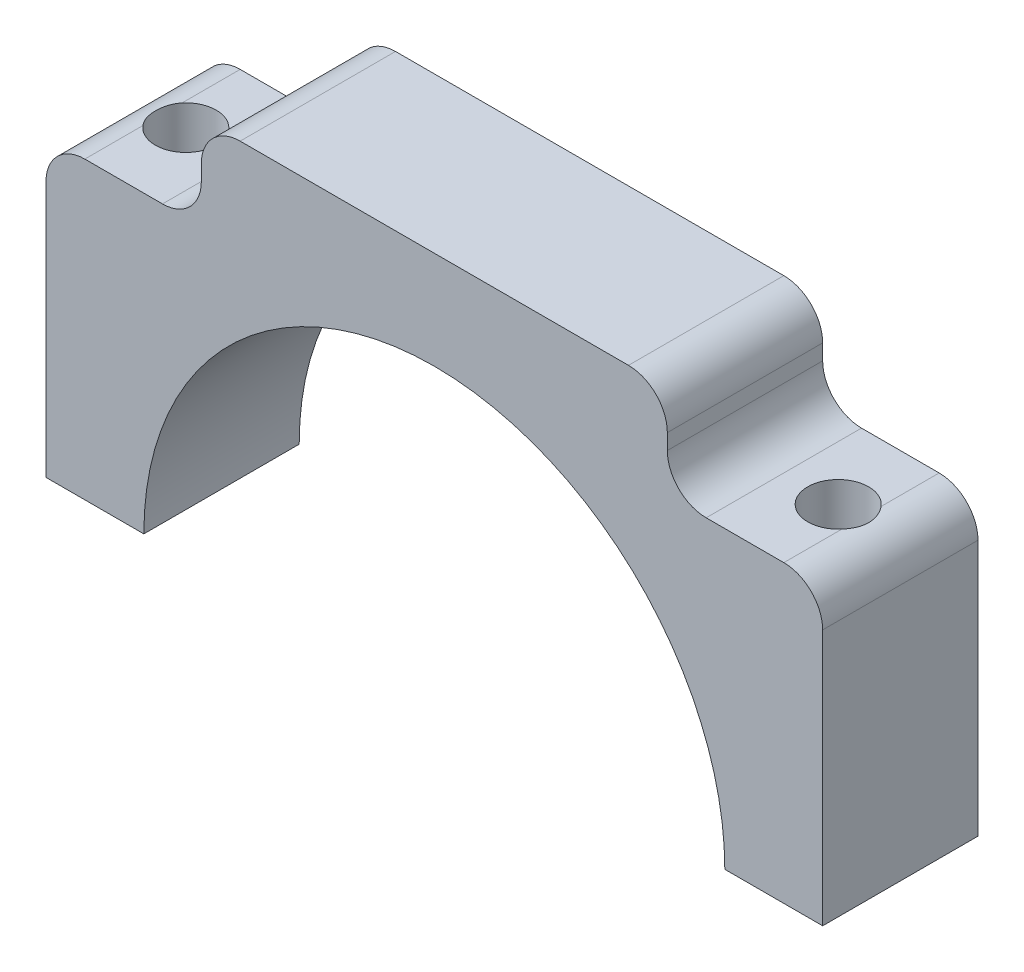
ISO-10303-21;
HEADER;
FILE_DESCRIPTION(('STEP AP214'),'2;1');
FILE_NAME('part.step','',(''),(''),'','','');
FILE_SCHEMA(('AUTOMOTIVE_DESIGN { 1 0 10303 214 1 1 1 1 }'));
ENDSEC;
DATA;
#1=APPLICATION_CONTEXT('core data for automotive mechanical design processes');
#2=APPLICATION_PROTOCOL_DEFINITION('international standard','automotive_design',2000,#1);
#3=PRODUCT_CONTEXT('',#1,'mechanical');
#4=PRODUCT('Part','Part','',(#3));
#5=PRODUCT_RELATED_PRODUCT_CATEGORY('part','',(#4));
#6=PRODUCT_DEFINITION_FORMATION('','',#4);
#7=PRODUCT_DEFINITION_CONTEXT('part definition',#1,'design');
#8=PRODUCT_DEFINITION('design','',#6,#7);
#9=PRODUCT_DEFINITION_SHAPE('','',#8);
#10=(LENGTH_UNIT() NAMED_UNIT(*) SI_UNIT(.MILLI.,.METRE.));
#11=(NAMED_UNIT(*) PLANE_ANGLE_UNIT() SI_UNIT($,.RADIAN.));
#12=(NAMED_UNIT(*) SI_UNIT($,.STERADIAN.) SOLID_ANGLE_UNIT());
#13=UNCERTAINTY_MEASURE_WITH_UNIT(LENGTH_MEASURE(1.E-05),#10,'distance_accuracy_value','');
#14=(GEOMETRIC_REPRESENTATION_CONTEXT(3) GLOBAL_UNCERTAINTY_ASSIGNED_CONTEXT((#13)) GLOBAL_UNIT_ASSIGNED_CONTEXT((#10,
#11,#12)) REPRESENTATION_CONTEXT('',''));
#15=CARTESIAN_POINT('',(0.,0.,0.));
#16=DIRECTION('',(0.,0.,1.));
#17=DIRECTION('',(1.,0.,0.));
#18=AXIS2_PLACEMENT_3D('',#15,#16,#17);
#19=CARTESIAN_POINT('',(5.08,0.,6.35));
#20=DIRECTION('',(0.,1.,0.));
#21=DIRECTION('',(0.,0.,1.));
#22=AXIS2_PLACEMENT_3D('',#19,#20,#21);
#23=CYLINDRICAL_SURFACE('',#22,2.4892);
#24=CARTESIAN_POINT('',(5.08,0.,6.35));
#25=DIRECTION('',(0.,1.,0.));
#26=DIRECTION('',(0.,0.,1.));
#27=AXIS2_PLACEMENT_3D('',#24,#25,#26);
#28=CIRCLE('',#27,2.4892);
#29=CARTESIAN_POINT('',(5.08,0.,8.8392));
#30=VERTEX_POINT('',#29);
#31=EDGE_CURVE('E20',#30,#30,#28,.T.);
#32=ORIENTED_EDGE('',*,*,#31,.F.);
#33=EDGE_LOOP('',(#32));
#34=FACE_BOUND('',#33,.T.);
#35=CARTESIAN_POINT('',(3.17500000000001,24.13,7.95221460485168));
#36=CARTESIAN_POINT('',(3.13009008970398,24.1299967142231,7.89881831780775));
#37=CARTESIAN_POINT('',(3.08745644404655,24.1290478568266,7.8435672925134));
#38=CARTESIAN_POINT('',(3.00699891355422,24.1258080863664,7.72972582153411));
#39=CARTESIAN_POINT('',(2.96917368836943,24.1235175482998,7.67113631307729));
#40=CARTESIAN_POINT('',(2.86332907607308,24.1154607832854,7.4909851985496));
#41=CARTESIAN_POINT('',(2.80285253669607,24.1085072655136,7.36493585667964));
#42=CARTESIAN_POINT('',(2.70382466724712,24.0952441325717,7.10454246043218));
#43=CARTESIAN_POINT('',(2.66527289966045,24.0889345045547,6.97019857163392));
#44=CARTESIAN_POINT('',(2.61116595259049,24.07965690608,6.69690903039815));
#45=CARTESIAN_POINT('',(2.59559400457558,24.0766864993471,6.55796680916758));
#46=CARTESIAN_POINT('',(2.58791295947405,24.075251820073,6.27981471864946));
#47=CARTESIAN_POINT('',(2.59573673857648,24.0767746559696,6.14060675803374));
#48=CARTESIAN_POINT('',(2.63447095135223,24.0837105380802,5.86540883877533));
#49=CARTESIAN_POINT('',(2.66540403680886,24.0891274010296,5.7294221726715));
#50=CARTESIAN_POINT('',(2.74929500009011,24.101613973945,5.4650595131953));
#51=CARTESIAN_POINT('',(2.80217670244165,24.1086779306616,5.33665893507231));
#52=CARTESIAN_POINT('',(2.92848806578774,24.1210470627378,5.09057704001316));
#53=CARTESIAN_POINT('',(3.00186726045746,24.126356488667,4.97287032550667));
#54=CARTESIAN_POINT('',(3.113494709584,24.1295357223754,4.8231186762778));
#55=CARTESIAN_POINT('',(3.14370286838516,24.1299968857,4.78498231767798));
#56=CARTESIAN_POINT('',(3.175,24.13,4.74778539514833));
#57=B_SPLINE_CURVE_WITH_KNOTS('',3,(#35,#36,#37,#38,#39,#40,#41,#42,#43,#44,#45,#46,#47,#48,#49,
#50,#51,#52,#53,#54,#55,#56),.UNSPECIFIED.,.F.,.F.,(4,2,2,2,2,2,2,2,2,2,4),(0.,
0.209163167064139,0.418267901330207,0.836070909738818,1.25386558048326,1.67135523258791,
2.08764823096986,2.50434981675861,2.91961712201849,3.33387088626258,3.4797384557396),.UNSPECIFIED.);
#58=CARTESIAN_POINT('',(3.175,24.13,7.95221460485168));
#59=VERTEX_POINT('',#58);
#60=CARTESIAN_POINT('',(3.175,24.13,4.74778539514833));
#61=VERTEX_POINT('',#60);
#62=EDGE_CURVE('E123',#59,#61,#57,.T.);
#63=ORIENTED_EDGE('',*,*,#62,.F.);
#64=CARTESIAN_POINT('',(5.08,24.13,6.35));
#65=DIRECTION('',(0.,1.,0.));
#66=DIRECTION('',(0.,0.,1.));
#67=AXIS2_PLACEMENT_3D('',#64,#65,#66);
#68=CIRCLE('',#67,2.4892);
#69=EDGE_CURVE('E135',#61,#59,#68,.F.);
#70=ORIENTED_EDGE('',*,*,#69,.F.);
#71=EDGE_LOOP('',(#63,#70));
#72=FACE_BOUND('',#71,.T.);
#73=ADVANCED_FACE('F16',(#34,#72),#23,.F.);
#74=CARTESIAN_POINT('',(31.75,0.,0.));
#75=DIRECTION('',(0.,0.,1.));
#76=DIRECTION('',(1.,0.,0.));
#77=AXIS2_PLACEMENT_3D('',#74,#75,#76);
#78=CYLINDRICAL_SURFACE('',#77,23.75);
#79=DIRECTION('',(0.,0.,-1.));
#80=VECTOR('',#79,1.);
#81=CARTESIAN_POINT('',(8.00000000000001,0.,0.));
#82=LINE('',#81,#80);
#83=CARTESIAN_POINT('',(8.00000000000001,0.,0.));
#84=VERTEX_POINT('',#83);
#85=CARTESIAN_POINT('',(8.00000000000001,0.,12.7));
#86=VERTEX_POINT('',#85);
#87=EDGE_CURVE('E152',#84,#86,#82,.F.);
#88=ORIENTED_EDGE('',*,*,#87,.F.);
#89=CARTESIAN_POINT('',(31.75,0.,0.));
#90=DIRECTION('',(0.,0.,1.));
#91=DIRECTION('',(1.,0.,0.));
#92=AXIS2_PLACEMENT_3D('',#89,#90,#91);
#93=CIRCLE('',#92,23.75);
#94=CARTESIAN_POINT('',(55.5,0.,0.));
#95=VERTEX_POINT('',#94);
#96=EDGE_CURVE('E264',#95,#84,#93,.T.);
#97=ORIENTED_EDGE('',*,*,#96,.F.);
#98=DIRECTION('',(0.,0.,-1.));
#99=VECTOR('',#98,1.);
#100=CARTESIAN_POINT('',(55.5,0.,0.));
#101=LINE('',#100,#99);
#102=CARTESIAN_POINT('',(55.5,0.,12.7));
#103=VERTEX_POINT('',#102);
#104=EDGE_CURVE('E154',#103,#95,#101,.T.);
#105=ORIENTED_EDGE('',*,*,#104,.F.);
#106=CARTESIAN_POINT('',(31.75,0.,12.7));
#107=DIRECTION('',(0.,0.,1.));
#108=DIRECTION('',(1.,0.,0.));
#109=AXIS2_PLACEMENT_3D('',#106,#107,#108);
#110=CIRCLE('',#109,23.75);
#111=EDGE_CURVE('E259',#86,#103,#110,.F.);
#112=ORIENTED_EDGE('',*,*,#111,.F.);
#113=EDGE_LOOP('',(#88,#97,#105,#112));
#114=FACE_BOUND('',#113,.T.);
#115=ADVANCED_FACE('F514',(#114),#78,.F.);
#116=CARTESIAN_POINT('',(63.5,0.,0.));
#117=DIRECTION('',(0.,-1.,0.));
#118=DIRECTION('',(0.,0.,-1.));
#119=AXIS2_PLACEMENT_3D('',#116,#117,#118);
#120=PLANE('',#119);
#121=ORIENTED_EDGE('',*,*,#31,.T.);
#122=EDGE_LOOP('',(#121));
#123=FACE_BOUND('',#122,.T.);
#124=DIRECTION('',(0.,0.,1.));
#125=VECTOR('',#124,1.);
#126=CARTESIAN_POINT('',(0.,0.,0.));
#127=LINE('',#126,#125);
#128=CARTESIAN_POINT('',(0.,0.,0.));
#129=VERTEX_POINT('',#128);
#130=CARTESIAN_POINT('',(0.,0.,12.7));
#131=VERTEX_POINT('',#130);
#132=EDGE_CURVE('E147',#129,#131,#127,.T.);
#133=ORIENTED_EDGE('',*,*,#132,.F.);
#134=DIRECTION('',(-1.,0.,0.));
#135=VECTOR('',#134,1.);
#136=CARTESIAN_POINT('',(31.75,0.,0.));
#137=LINE('',#136,#135);
#138=EDGE_CURVE('E267',#84,#129,#137,.T.);
#139=ORIENTED_EDGE('',*,*,#138,.F.);
#140=ORIENTED_EDGE('',*,*,#87,.T.);
#141=DIRECTION('',(1.,0.,0.));
#142=VECTOR('',#141,1.);
#143=CARTESIAN_POINT('',(31.75,0.,12.7));
#144=LINE('',#143,#142);
#145=EDGE_CURVE('E263',#131,#86,#144,.T.);
#146=ORIENTED_EDGE('',*,*,#145,.F.);
#147=EDGE_LOOP('',(#133,#139,#140,#146));
#148=FACE_BOUND('',#147,.T.);
#149=ADVANCED_FACE('F506',(#123,#148),#120,.T.);
#150=CARTESIAN_POINT('',(0.,0.,0.));
#151=DIRECTION('',(-1.,0.,0.));
#152=DIRECTION('',(0.,0.,1.));
#153=AXIS2_PLACEMENT_3D('',#150,#151,#152);
#154=PLANE('',#153);
#155=ORIENTED_EDGE('',*,*,#132,.T.);
#156=DIRECTION('',(0.,1.,0.));
#157=VECTOR('',#156,1.);
#158=CARTESIAN_POINT('',(0.,15.875,12.7));
#159=LINE('',#158,#157);
#160=CARTESIAN_POINT('',(0.,20.955,12.7));
#161=VERTEX_POINT('',#160);
#162=EDGE_CURVE('E258',#161,#131,#159,.F.);
#163=ORIENTED_EDGE('',*,*,#162,.F.);
#164=DIRECTION('',(0.,0.,-1.));
#165=VECTOR('',#164,1.);
#166=CARTESIAN_POINT('',(0.,20.955,6.35));
#167=LINE('',#166,#165);
#168=CARTESIAN_POINT('',(0.,20.955,0.));
#169=VERTEX_POINT('',#168);
#170=EDGE_CURVE('E134',#169,#161,#167,.F.);
#171=ORIENTED_EDGE('',*,*,#170,.F.);
#172=DIRECTION('',(0.,1.,0.));
#173=VECTOR('',#172,1.);
#174=CARTESIAN_POINT('',(0.,15.875,0.));
#175=LINE('',#174,#173);
#176=EDGE_CURVE('E271',#129,#169,#175,.T.);
#177=ORIENTED_EDGE('',*,*,#176,.F.);
#178=EDGE_LOOP('',(#155,#163,#171,#177));
#179=FACE_BOUND('',#178,.T.);
#180=ADVANCED_FACE('F233',(#179),#154,.T.);
#181=CARTESIAN_POINT('',(3.175,20.955,12.7));
#182=DIRECTION('',(0.,0.,-1.));
#183=DIRECTION('',(-1.,0.,0.));
#184=AXIS2_PLACEMENT_3D('',#181,#182,#183);
#185=CYLINDRICAL_SURFACE('',#184,3.175);
#186=ORIENTED_EDGE('',*,*,#62,.T.);
#187=DIRECTION('',(0.,0.,1.));
#188=VECTOR('',#187,1.);
#189=CARTESIAN_POINT('',(3.175,24.13,12.7));
#190=LINE('',#189,#188);
#191=CARTESIAN_POINT('',(3.175,24.13,0.));
#192=VERTEX_POINT('',#191);
#193=EDGE_CURVE('E129',#192,#61,#190,.T.);
#194=ORIENTED_EDGE('',*,*,#193,.F.);
#195=CARTESIAN_POINT('',(3.175,20.955,0.));
#196=DIRECTION('',(0.,0.,-1.));
#197=DIRECTION('',(-1.,0.,0.));
#198=AXIS2_PLACEMENT_3D('',#195,#196,#197);
#199=CIRCLE('',#198,3.175);
#200=EDGE_CURVE('E269',#169,#192,#199,.T.);
#201=ORIENTED_EDGE('',*,*,#200,.F.);
#202=ORIENTED_EDGE('',*,*,#170,.T.);
#203=CARTESIAN_POINT('',(3.175,20.955,12.7));
#204=DIRECTION('',(0.,0.,-1.));
#205=DIRECTION('',(-1.,0.,0.));
#206=AXIS2_PLACEMENT_3D('',#203,#204,#205);
#207=CIRCLE('',#206,3.175);
#208=CARTESIAN_POINT('',(3.175,24.13,12.7));
#209=VERTEX_POINT('',#208);
#210=EDGE_CURVE('E255',#209,#161,#207,.F.);
#211=ORIENTED_EDGE('',*,*,#210,.F.);
#212=DIRECTION('',(0.,0.,1.));
#213=VECTOR('',#212,1.);
#214=CARTESIAN_POINT('',(3.175,24.13,12.7));
#215=LINE('',#214,#213);
#216=EDGE_CURVE('E132',#59,#209,#215,.T.);
#217=ORIENTED_EDGE('',*,*,#216,.F.);
#218=EDGE_LOOP('',(#186,#194,#201,#202,#211,#217));
#219=FACE_BOUND('',#218,.T.);
#220=ADVANCED_FACE('F126',(#219),#185,.T.);
#221=CARTESIAN_POINT('',(0.,24.13,12.7));
#222=DIRECTION('',(0.,1.,0.));
#223=DIRECTION('',(0.,0.,1.));
#224=AXIS2_PLACEMENT_3D('',#221,#222,#223);
#225=PLANE('',#224);
#226=ORIENTED_EDGE('',*,*,#216,.T.);
#227=DIRECTION('',(1.,0.,0.));
#228=VECTOR('',#227,1.);
#229=CARTESIAN_POINT('',(31.75,24.13,12.7));
#230=LINE('',#229,#228);
#231=CARTESIAN_POINT('',(9.525,24.13,12.7));
#232=VERTEX_POINT('',#231);
#233=EDGE_CURVE('E254',#232,#209,#230,.F.);
#234=ORIENTED_EDGE('',*,*,#233,.F.);
#235=DIRECTION('',(0.,0.,1.));
#236=VECTOR('',#235,1.);
#237=CARTESIAN_POINT('',(9.525,24.13,6.35));
#238=LINE('',#237,#236);
#239=CARTESIAN_POINT('',(9.525,24.13,0.));
#240=VERTEX_POINT('',#239);
#241=EDGE_CURVE('E366',#240,#232,#238,.T.);
#242=ORIENTED_EDGE('',*,*,#241,.F.);
#243=DIRECTION('',(-1.,0.,0.));
#244=VECTOR('',#243,1.);
#245=CARTESIAN_POINT('',(31.75,24.13,0.));
#246=LINE('',#245,#244);
#247=EDGE_CURVE('E140',#192,#240,#246,.F.);
#248=ORIENTED_EDGE('',*,*,#247,.F.);
#249=ORIENTED_EDGE('',*,*,#193,.T.);
#250=ORIENTED_EDGE('',*,*,#69,.T.);
#251=EDGE_LOOP('',(#226,#234,#242,#248,#249,#250));
#252=FACE_BOUND('',#251,.T.);
#253=ADVANCED_FACE('F138',(#252),#225,.T.);
#254=CARTESIAN_POINT('',(9.525,27.305,12.7));
#255=DIRECTION('',(0.,0.,-1.));
#256=DIRECTION('',(-1.,0.,0.));
#257=AXIS2_PLACEMENT_3D('',#254,#255,#256);
#258=CYLINDRICAL_SURFACE('',#257,3.17499999999998);
#259=CARTESIAN_POINT('',(9.525,27.305,0.));
#260=DIRECTION('',(0.,0.,-1.));
#261=DIRECTION('',(-1.,0.,0.));
#262=AXIS2_PLACEMENT_3D('',#259,#260,#261);
#263=CIRCLE('',#262,3.17499999999998);
#264=CARTESIAN_POINT('',(12.7,27.305,0.));
#265=VERTEX_POINT('',#264);
#266=EDGE_CURVE('E272',#240,#265,#263,.F.);
#267=ORIENTED_EDGE('',*,*,#266,.F.);
#268=ORIENTED_EDGE('',*,*,#241,.T.);
#269=CARTESIAN_POINT('',(9.525,27.305,12.7));
#270=DIRECTION('',(0.,0.,-1.));
#271=DIRECTION('',(-1.,0.,0.));
#272=AXIS2_PLACEMENT_3D('',#269,#270,#271);
#273=CIRCLE('',#272,3.17499999999998);
#274=CARTESIAN_POINT('',(12.7,27.305,12.7));
#275=VERTEX_POINT('',#274);
#276=EDGE_CURVE('E251',#275,#232,#273,.T.);
#277=ORIENTED_EDGE('',*,*,#276,.F.);
#278=DIRECTION('',(0.,0.,1.));
#279=VECTOR('',#278,1.);
#280=CARTESIAN_POINT('',(12.7,27.305,12.7));
#281=LINE('',#280,#279);
#282=EDGE_CURVE('E365',#265,#275,#281,.T.);
#283=ORIENTED_EDGE('',*,*,#282,.F.);
#284=EDGE_LOOP('',(#267,#268,#277,#283));
#285=FACE_BOUND('',#284,.T.);
#286=ADVANCED_FACE('F223',(#285),#258,.F.);
#287=CARTESIAN_POINT('',(12.7,24.13,12.7));
#288=DIRECTION('',(-1.,0.,0.));
#289=DIRECTION('',(0.,0.,1.));
#290=AXIS2_PLACEMENT_3D('',#287,#288,#289);
#291=PLANE('',#290);
#292=ORIENTED_EDGE('',*,*,#282,.T.);
#293=DIRECTION('',(0.,1.,0.));
#294=VECTOR('',#293,1.);
#295=CARTESIAN_POINT('',(12.7,15.875,12.7));
#296=LINE('',#295,#294);
#297=CARTESIAN_POINT('',(12.7,28.575,12.7));
#298=VERTEX_POINT('',#297);
#299=EDGE_CURVE('E250',#298,#275,#296,.F.);
#300=ORIENTED_EDGE('',*,*,#299,.F.);
#301=DIRECTION('',(0.,0.,1.));
#302=VECTOR('',#301,1.);
#303=CARTESIAN_POINT('',(12.7,28.575,6.35));
#304=LINE('',#303,#302);
#305=CARTESIAN_POINT('',(12.7,28.575,0.));
#306=VERTEX_POINT('',#305);
#307=EDGE_CURVE('E363',#306,#298,#304,.T.);
#308=ORIENTED_EDGE('',*,*,#307,.F.);
#309=DIRECTION('',(0.,1.,0.));
#310=VECTOR('',#309,1.);
#311=CARTESIAN_POINT('',(12.7,15.875,0.));
#312=LINE('',#311,#310);
#313=EDGE_CURVE('E275',#265,#306,#312,.T.);
#314=ORIENTED_EDGE('',*,*,#313,.F.);
#315=EDGE_LOOP('',(#292,#300,#308,#314));
#316=FACE_BOUND('',#315,.T.);
#317=ADVANCED_FACE('F219',(#316),#291,.T.);
#318=CARTESIAN_POINT('',(15.875,28.575,0.));
#319=DIRECTION('',(0.,0.,1.));
#320=DIRECTION('',(1.,0.,0.));
#321=AXIS2_PLACEMENT_3D('',#318,#319,#320);
#322=CYLINDRICAL_SURFACE('',#321,3.175);
#323=CARTESIAN_POINT('',(15.875,28.575,0.));
#324=DIRECTION('',(0.,0.,1.));
#325=DIRECTION('',(1.,0.,0.));
#326=AXIS2_PLACEMENT_3D('',#323,#324,#325);
#327=CIRCLE('',#326,3.175);
#328=CARTESIAN_POINT('',(15.875,31.75,0.));
#329=VERTEX_POINT('',#328);
#330=EDGE_CURVE('E276',#306,#329,#327,.F.);
#331=ORIENTED_EDGE('',*,*,#330,.F.);
#332=ORIENTED_EDGE('',*,*,#307,.T.);
#333=CARTESIAN_POINT('',(15.875,28.575,12.7));
#334=DIRECTION('',(0.,0.,1.));
#335=DIRECTION('',(1.,0.,0.));
#336=AXIS2_PLACEMENT_3D('',#333,#334,#335);
#337=CIRCLE('',#336,3.175);
#338=CARTESIAN_POINT('',(15.875,31.75,12.7));
#339=VERTEX_POINT('',#338);
#340=EDGE_CURVE('E247',#339,#298,#337,.T.);
#341=ORIENTED_EDGE('',*,*,#340,.F.);
#342=DIRECTION('',(0.,0.,1.));
#343=VECTOR('',#342,1.);
#344=CARTESIAN_POINT('',(15.875,31.75,0.));
#345=LINE('',#344,#343);
#346=EDGE_CURVE('E361',#329,#339,#345,.T.);
#347=ORIENTED_EDGE('',*,*,#346,.F.);
#348=EDGE_LOOP('',(#331,#332,#341,#347));
#349=FACE_BOUND('',#348,.T.);
#350=ADVANCED_FACE('F215',(#349),#322,.T.);
#351=CARTESIAN_POINT('',(0.,31.75,0.));
#352=DIRECTION('',(0.,1.,0.));
#353=DIRECTION('',(0.,0.,1.));
#354=AXIS2_PLACEMENT_3D('',#351,#352,#353);
#355=PLANE('',#354);
#356=ORIENTED_EDGE('',*,*,#346,.T.);
#357=DIRECTION('',(1.,0.,0.));
#358=VECTOR('',#357,1.);
#359=CARTESIAN_POINT('',(31.75,31.75,12.7));
#360=LINE('',#359,#358);
#361=CARTESIAN_POINT('',(47.625,31.75,12.7));
#362=VERTEX_POINT('',#361);
#363=EDGE_CURVE('E246',#362,#339,#360,.F.);
#364=ORIENTED_EDGE('',*,*,#363,.F.);
#365=DIRECTION('',(0.,0.,-1.));
#366=VECTOR('',#365,1.);
#367=CARTESIAN_POINT('',(47.625,31.75,6.35));
#368=LINE('',#367,#366);
#369=CARTESIAN_POINT('',(47.625,31.75,0.));
#370=VERTEX_POINT('',#369);
#371=EDGE_CURVE('E359',#370,#362,#368,.F.);
#372=ORIENTED_EDGE('',*,*,#371,.F.);
#373=DIRECTION('',(-1.,0.,0.));
#374=VECTOR('',#373,1.);
#375=CARTESIAN_POINT('',(31.75,31.75,0.));
#376=LINE('',#375,#374);
#377=EDGE_CURVE('E279',#329,#370,#376,.F.);
#378=ORIENTED_EDGE('',*,*,#377,.F.);
#379=EDGE_LOOP('',(#356,#364,#372,#378));
#380=FACE_BOUND('',#379,.T.);
#381=ADVANCED_FACE('F211',(#380),#355,.T.);
#382=CARTESIAN_POINT('',(47.625,28.575,12.7));
#383=DIRECTION('',(0.,0.,-1.));
#384=DIRECTION('',(-1.,0.,0.));
#385=AXIS2_PLACEMENT_3D('',#382,#383,#384);
#386=CYLINDRICAL_SURFACE('',#385,3.175);
#387=CARTESIAN_POINT('',(47.625,28.575,12.7));
#388=DIRECTION('',(0.,0.,-1.));
#389=DIRECTION('',(-1.,0.,0.));
#390=AXIS2_PLACEMENT_3D('',#387,#388,#389);
#391=CIRCLE('',#390,3.175);
#392=CARTESIAN_POINT('',(50.8,28.575,12.7));
#393=VERTEX_POINT('',#392);
#394=EDGE_CURVE('E243',#393,#362,#391,.F.);
#395=ORIENTED_EDGE('',*,*,#394,.F.);
#396=DIRECTION('',(0.,0.,-1.));
#397=VECTOR('',#396,1.);
#398=CARTESIAN_POINT('',(50.8,28.575,12.7));
#399=LINE('',#398,#397);
#400=CARTESIAN_POINT('',(50.8,28.575,0.));
#401=VERTEX_POINT('',#400);
#402=EDGE_CURVE('E157',#401,#393,#399,.F.);
#403=ORIENTED_EDGE('',*,*,#402,.F.);
#404=CARTESIAN_POINT('',(47.625,28.575,0.));
#405=DIRECTION('',(0.,0.,-1.));
#406=DIRECTION('',(-1.,0.,0.));
#407=AXIS2_PLACEMENT_3D('',#404,#405,#406);
#408=CIRCLE('',#407,3.175);
#409=EDGE_CURVE('E280',#370,#401,#408,.T.);
#410=ORIENTED_EDGE('',*,*,#409,.F.);
#411=ORIENTED_EDGE('',*,*,#371,.T.);
#412=EDGE_LOOP('',(#395,#403,#410,#411));
#413=FACE_BOUND('',#412,.T.);
#414=ADVANCED_FACE('F207',(#413),#386,.T.);
#415=CARTESIAN_POINT('',(50.8,24.13,12.7));
#416=DIRECTION('',(1.,0.,0.));
#417=DIRECTION('',(0.,0.,-1.));
#418=AXIS2_PLACEMENT_3D('',#415,#416,#417);
#419=PLANE('',#418);
#420=ORIENTED_EDGE('',*,*,#402,.T.);
#421=DIRECTION('',(0.,1.,0.));
#422=VECTOR('',#421,1.);
#423=CARTESIAN_POINT('',(50.8,15.875,12.7));
#424=LINE('',#423,#422);
#425=CARTESIAN_POINT('',(50.8,27.305,12.7));
#426=VERTEX_POINT('',#425);
#427=EDGE_CURVE('E242',#426,#393,#424,.T.);
#428=ORIENTED_EDGE('',*,*,#427,.F.);
#429=DIRECTION('',(0.,0.,1.));
#430=VECTOR('',#429,1.);
#431=CARTESIAN_POINT('',(50.8,27.305,6.35));
#432=LINE('',#431,#430);
#433=CARTESIAN_POINT('',(50.8,27.305,0.));
#434=VERTEX_POINT('',#433);
#435=EDGE_CURVE('E156',#434,#426,#432,.T.);
#436=ORIENTED_EDGE('',*,*,#435,.F.);
#437=DIRECTION('',(0.,1.,0.));
#438=VECTOR('',#437,1.);
#439=CARTESIAN_POINT('',(50.8,15.875,0.));
#440=LINE('',#439,#438);
#441=EDGE_CURVE('E283',#401,#434,#440,.F.);
#442=ORIENTED_EDGE('',*,*,#441,.F.);
#443=EDGE_LOOP('',(#420,#428,#436,#442));
#444=FACE_BOUND('',#443,.T.);
#445=ADVANCED_FACE('F203',(#444),#419,.T.);
#446=CARTESIAN_POINT('',(63.5,0.,0.));
#447=DIRECTION('',(0.,-1.,0.));
#448=DIRECTION('',(0.,0.,-1.));
#449=AXIS2_PLACEMENT_3D('',#446,#447,#448);
#450=PLANE('',#449);
#451=CARTESIAN_POINT('',(58.42,0.,6.35));
#452=DIRECTION('',(0.,-1.,0.));
#453=DIRECTION('',(0.,0.,-1.));
#454=AXIS2_PLACEMENT_3D('',#451,#452,#453);
#455=CIRCLE('',#454,2.4892);
#456=CARTESIAN_POINT('',(58.42,0.,3.8608));
#457=VERTEX_POINT('',#456);
#458=EDGE_CURVE('E286',#457,#457,#455,.T.);
#459=ORIENTED_EDGE('',*,*,#458,.F.);
#460=EDGE_LOOP('',(#459));
#461=FACE_BOUND('',#460,.T.);
#462=DIRECTION('',(0.,0.,-1.));
#463=VECTOR('',#462,1.);
#464=CARTESIAN_POINT('',(63.5,0.,0.));
#465=LINE('',#464,#463);
#466=CARTESIAN_POINT('',(63.5,0.,12.7));
#467=VERTEX_POINT('',#466);
#468=CARTESIAN_POINT('',(63.5,0.,0.));
#469=VERTEX_POINT('',#468);
#470=EDGE_CURVE('E158',#467,#469,#465,.T.);
#471=ORIENTED_EDGE('',*,*,#470,.F.);
#472=DIRECTION('',(1.,0.,0.));
#473=VECTOR('',#472,1.);
#474=CARTESIAN_POINT('',(31.75,0.,12.7));
#475=LINE('',#474,#473);
#476=EDGE_CURVE('E262',#103,#467,#475,.T.);
#477=ORIENTED_EDGE('',*,*,#476,.F.);
#478=ORIENTED_EDGE('',*,*,#104,.T.);
#479=DIRECTION('',(-1.,0.,0.));
#480=VECTOR('',#479,1.);
#481=CARTESIAN_POINT('',(31.75,0.,0.));
#482=LINE('',#481,#480);
#483=EDGE_CURVE('E268',#469,#95,#482,.T.);
#484=ORIENTED_EDGE('',*,*,#483,.F.);
#485=EDGE_LOOP('',(#471,#477,#478,#484));
#486=FACE_BOUND('',#485,.T.);
#487=ADVANCED_FACE('F199',(#461,#486),#450,.T.);
#488=CARTESIAN_POINT('',(53.975,27.305,12.7));
#489=DIRECTION('',(0.,0.,-1.));
#490=DIRECTION('',(-1.,0.,0.));
#491=AXIS2_PLACEMENT_3D('',#488,#489,#490);
#492=CYLINDRICAL_SURFACE('',#491,3.17500000000002);
#493=CARTESIAN_POINT('',(53.975,27.305,0.));
#494=DIRECTION('',(0.,0.,-1.));
#495=DIRECTION('',(-1.,0.,0.));
#496=AXIS2_PLACEMENT_3D('',#493,#494,#495);
#497=CIRCLE('',#496,3.17500000000002);
#498=CARTESIAN_POINT('',(53.975,24.13,0.));
#499=VERTEX_POINT('',#498);
#500=EDGE_CURVE('E284',#434,#499,#497,.F.);
#501=ORIENTED_EDGE('',*,*,#500,.F.);
#502=ORIENTED_EDGE('',*,*,#435,.T.);
#503=CARTESIAN_POINT('',(53.975,27.305,12.7));
#504=DIRECTION('',(0.,0.,-1.));
#505=DIRECTION('',(-1.,0.,0.));
#506=AXIS2_PLACEMENT_3D('',#503,#504,#505);
#507=CIRCLE('',#506,3.17500000000002);
#508=CARTESIAN_POINT('',(53.975,24.13,12.7));
#509=VERTEX_POINT('',#508);
#510=EDGE_CURVE('E239',#509,#426,#507,.T.);
#511=ORIENTED_EDGE('',*,*,#510,.F.);
#512=DIRECTION('',(0.,0.,1.));
#513=VECTOR('',#512,1.);
#514=CARTESIAN_POINT('',(53.975,24.13,12.7));
#515=LINE('',#514,#513);
#516=EDGE_CURVE('E299',#499,#509,#515,.T.);
#517=ORIENTED_EDGE('',*,*,#516,.F.);
#518=EDGE_LOOP('',(#501,#502,#511,#517));
#519=FACE_BOUND('',#518,.T.);
#520=ADVANCED_FACE('F195',(#519),#492,.F.);
#521=CARTESIAN_POINT('',(31.75,15.875,12.7));
#522=DIRECTION('',(0.,0.,1.));
#523=DIRECTION('',(1.,0.,0.));
#524=AXIS2_PLACEMENT_3D('',#521,#522,#523);
#525=PLANE('',#524);
#526=ORIENTED_EDGE('',*,*,#476,.T.);
#527=DIRECTION('',(0.,1.,0.));
#528=VECTOR('',#527,1.);
#529=CARTESIAN_POINT('',(63.5,31.75,12.7));
#530=LINE('',#529,#528);
#531=CARTESIAN_POINT('',(63.5,20.955,12.7));
#532=VERTEX_POINT('',#531);
#533=EDGE_CURVE('E162',#532,#467,#530,.F.);
#534=ORIENTED_EDGE('',*,*,#533,.F.);
#535=CARTESIAN_POINT('',(60.325,20.955,12.7));
#536=DIRECTION('',(0.,0.,1.));
#537=DIRECTION('',(1.,0.,0.));
#538=AXIS2_PLACEMENT_3D('',#535,#536,#537);
#539=CIRCLE('',#538,3.175);
#540=CARTESIAN_POINT('',(60.325,24.13,12.7));
#541=VERTEX_POINT('',#540);
#542=EDGE_CURVE('E290',#541,#532,#539,.F.);
#543=ORIENTED_EDGE('',*,*,#542,.F.);
#544=DIRECTION('',(1.,0.,0.));
#545=VECTOR('',#544,1.);
#546=CARTESIAN_POINT('',(63.5,24.13,12.7));
#547=LINE('',#546,#545);
#548=EDGE_CURVE('E293',#509,#541,#547,.T.);
#549=ORIENTED_EDGE('',*,*,#548,.F.);
#550=ORIENTED_EDGE('',*,*,#510,.T.);
#551=ORIENTED_EDGE('',*,*,#427,.T.);
#552=ORIENTED_EDGE('',*,*,#394,.T.);
#553=ORIENTED_EDGE('',*,*,#363,.T.);
#554=ORIENTED_EDGE('',*,*,#340,.T.);
#555=ORIENTED_EDGE('',*,*,#299,.T.);
#556=ORIENTED_EDGE('',*,*,#276,.T.);
#557=ORIENTED_EDGE('',*,*,#233,.T.);
#558=ORIENTED_EDGE('',*,*,#210,.T.);
#559=ORIENTED_EDGE('',*,*,#162,.T.);
#560=ORIENTED_EDGE('',*,*,#145,.T.);
#561=ORIENTED_EDGE('',*,*,#111,.T.);
#562=EDGE_LOOP('',(#526,#534,#543,#549,#550,#551,#552,#553,#554,#555,#556,#557,#558,#559,#560,#561));
#563=FACE_BOUND('',#562,.T.);
#564=ADVANCED_FACE('F191',(#563),#525,.T.);
#565=CARTESIAN_POINT('',(63.5,31.75,0.));
#566=DIRECTION('',(1.,0.,0.));
#567=DIRECTION('',(0.,0.,-1.));
#568=AXIS2_PLACEMENT_3D('',#565,#566,#567);
#569=PLANE('',#568);
#570=ORIENTED_EDGE('',*,*,#470,.T.);
#571=DIRECTION('',(0.,1.,0.));
#572=VECTOR('',#571,1.);
#573=CARTESIAN_POINT('',(63.5,15.875,0.));
#574=LINE('',#573,#572);
#575=CARTESIAN_POINT('',(63.5,20.955,0.));
#576=VERTEX_POINT('',#575);
#577=EDGE_CURVE('E161',#576,#469,#574,.F.);
#578=ORIENTED_EDGE('',*,*,#577,.F.);
#579=DIRECTION('',(0.,0.,1.));
#580=VECTOR('',#579,1.);
#581=CARTESIAN_POINT('',(63.5,20.955,6.35));
#582=LINE('',#581,#580);
#583=EDGE_CURVE('E292',#532,#576,#582,.F.);
#584=ORIENTED_EDGE('',*,*,#583,.F.);
#585=ORIENTED_EDGE('',*,*,#533,.T.);
#586=EDGE_LOOP('',(#570,#578,#584,#585));
#587=FACE_BOUND('',#586,.T.);
#588=ADVANCED_FACE('F187',(#587),#569,.T.);
#589=CARTESIAN_POINT('',(31.75,15.875,0.));
#590=DIRECTION('',(0.,0.,-1.));
#591=DIRECTION('',(-1.,0.,0.));
#592=AXIS2_PLACEMENT_3D('',#589,#590,#591);
#593=PLANE('',#592);
#594=ORIENTED_EDGE('',*,*,#500,.T.);
#595=DIRECTION('',(1.,0.,0.));
#596=VECTOR('',#595,1.);
#597=CARTESIAN_POINT('',(63.5,24.13,0.));
#598=LINE('',#597,#596);
#599=CARTESIAN_POINT('',(60.325,24.13,0.));
#600=VERTEX_POINT('',#599);
#601=EDGE_CURVE('E289',#600,#499,#598,.F.);
#602=ORIENTED_EDGE('',*,*,#601,.F.);
#603=CARTESIAN_POINT('',(60.325,20.955,0.));
#604=DIRECTION('',(0.,0.,1.));
#605=DIRECTION('',(1.,0.,0.));
#606=AXIS2_PLACEMENT_3D('',#603,#604,#605);
#607=CIRCLE('',#606,3.175);
#608=EDGE_CURVE('E173',#576,#600,#607,.T.);
#609=ORIENTED_EDGE('',*,*,#608,.F.);
#610=ORIENTED_EDGE('',*,*,#577,.T.);
#611=ORIENTED_EDGE('',*,*,#483,.T.);
#612=ORIENTED_EDGE('',*,*,#96,.T.);
#613=ORIENTED_EDGE('',*,*,#138,.T.);
#614=ORIENTED_EDGE('',*,*,#176,.T.);
#615=ORIENTED_EDGE('',*,*,#200,.T.);
#616=ORIENTED_EDGE('',*,*,#247,.T.);
#617=ORIENTED_EDGE('',*,*,#266,.T.);
#618=ORIENTED_EDGE('',*,*,#313,.T.);
#619=ORIENTED_EDGE('',*,*,#330,.T.);
#620=ORIENTED_EDGE('',*,*,#377,.T.);
#621=ORIENTED_EDGE('',*,*,#409,.T.);
#622=ORIENTED_EDGE('',*,*,#441,.T.);
#623=EDGE_LOOP('',(#594,#602,#609,#610,#611,#612,#613,#614,#615,#616,#617,#618,#619,#620,#621,#622));
#624=FACE_BOUND('',#623,.T.);
#625=ADVANCED_FACE('F183',(#624),#593,.T.);
#626=CARTESIAN_POINT('',(58.42,24.13,6.35));
#627=DIRECTION('',(0.,-1.,0.));
#628=DIRECTION('',(0.,0.,-1.));
#629=AXIS2_PLACEMENT_3D('',#626,#627,#628);
#630=CYLINDRICAL_SURFACE('',#629,2.4892);
#631=ORIENTED_EDGE('',*,*,#458,.T.);
#632=EDGE_LOOP('',(#631));
#633=FACE_BOUND('',#632,.T.);
#634=CARTESIAN_POINT('',(60.325,24.13,4.74778539514834));
#635=CARTESIAN_POINT('',(60.369909910296,24.1299967142232,4.80118168219227));
#636=CARTESIAN_POINT('',(60.4125435559535,24.1290478568266,4.85643270748662));
#637=CARTESIAN_POINT('',(60.4930010864458,24.1258080863664,4.97027417846591));
#638=CARTESIAN_POINT('',(60.5308263116306,24.1235175482998,5.02886368692273));
#639=CARTESIAN_POINT('',(60.6366709239269,24.1154607832854,5.20901480145042));
#640=CARTESIAN_POINT('',(60.6971474633039,24.1085072655136,5.33506414332038));
#641=CARTESIAN_POINT('',(60.7961753327529,24.0952441325717,5.59545753956784));
#642=CARTESIAN_POINT('',(60.8347271003396,24.0889345045547,5.7298014283661));
#643=CARTESIAN_POINT('',(60.8888340474095,24.07965690608,6.00309096960188));
#644=CARTESIAN_POINT('',(60.9044059954244,24.0766864993471,6.14203319083244));
#645=CARTESIAN_POINT('',(60.9120870405259,24.0752518200731,6.42018528135056));
#646=CARTESIAN_POINT('',(60.9042632614235,24.0767746559696,6.55939324196628));
#647=CARTESIAN_POINT('',(60.8655290486478,24.0837105380802,6.83459116122469));
#648=CARTESIAN_POINT('',(60.8345959631911,24.0891274010296,6.97057782732852));
#649=CARTESIAN_POINT('',(60.7507049999099,24.101613973945,7.23494048680471));
#650=CARTESIAN_POINT('',(60.6978232975583,24.1086779306616,7.36334106492771));
#651=CARTESIAN_POINT('',(60.5715119342122,24.1210470627378,7.60942295998686));
#652=CARTESIAN_POINT('',(60.4981327395425,24.1263564886671,7.72712967449334));
#653=CARTESIAN_POINT('',(60.386505290416,24.1295357223755,7.87688132372221));
#654=CARTESIAN_POINT('',(60.3562971316148,24.1299968857,7.91501768232203));
#655=CARTESIAN_POINT('',(60.325,24.13,7.95221460485166));
#656=B_SPLINE_CURVE_WITH_KNOTS('',3,(#634,#635,#636,#637,#638,#639,#640,#641,#642,#643,#644,
#645,#646,#647,#648,#649,#650,#651,#652,#653,#654,#655),.UNSPECIFIED.,.F.,.F.,(4,2,2,2,2,2,2,2,
2,2,4),(0.,0.209163167064141,0.418267901330209,0.836070909738817,1.25386558048326,
1.67135523258791,2.08764823096985,2.50434981675861,2.91961712201849,3.33387088626258,
3.47973845573957),.UNSPECIFIED.);
#657=CARTESIAN_POINT('',(60.325,24.13,4.74778539514833));
#658=VERTEX_POINT('',#657);
#659=CARTESIAN_POINT('',(60.325,24.13,7.95221460485167));
#660=VERTEX_POINT('',#659);
#661=EDGE_CURVE('E26',#658,#660,#656,.T.);
#662=ORIENTED_EDGE('',*,*,#661,.F.);
#663=CARTESIAN_POINT('',(58.42,24.13,6.35));
#664=DIRECTION('',(0.,-1.,0.));
#665=DIRECTION('',(0.,0.,-1.));
#666=AXIS2_PLACEMENT_3D('',#663,#664,#665);
#667=CIRCLE('',#666,2.4892);
#668=EDGE_CURVE('E34',#660,#658,#667,.T.);
#669=ORIENTED_EDGE('',*,*,#668,.F.);
#670=EDGE_LOOP('',(#662,#669));
#671=FACE_BOUND('',#670,.T.);
#672=ADVANCED_FACE('F178',(#633,#671),#630,.F.);
#673=CARTESIAN_POINT('',(63.5,24.13,12.7));
#674=DIRECTION('',(0.,1.,0.));
#675=DIRECTION('',(0.,0.,1.));
#676=AXIS2_PLACEMENT_3D('',#673,#674,#675);
#677=PLANE('',#676);
#678=ORIENTED_EDGE('',*,*,#516,.T.);
#679=ORIENTED_EDGE('',*,*,#548,.T.);
#680=DIRECTION('',(0.,0.,1.));
#681=VECTOR('',#680,1.);
#682=CARTESIAN_POINT('',(60.325,24.13,6.35));
#683=LINE('',#682,#681);
#684=EDGE_CURVE('E11',#660,#541,#683,.T.);
#685=ORIENTED_EDGE('',*,*,#684,.F.);
#686=ORIENTED_EDGE('',*,*,#668,.T.);
#687=DIRECTION('',(0.,0.,1.));
#688=VECTOR('',#687,1.);
#689=CARTESIAN_POINT('',(60.325,24.13,6.35));
#690=LINE('',#689,#688);
#691=EDGE_CURVE('E172',#600,#658,#690,.T.);
#692=ORIENTED_EDGE('',*,*,#691,.F.);
#693=ORIENTED_EDGE('',*,*,#601,.T.);
#694=EDGE_LOOP('',(#678,#679,#685,#686,#692,#693));
#695=FACE_BOUND('',#694,.T.);
#696=ADVANCED_FACE('F182',(#695),#677,.T.);
#697=CARTESIAN_POINT('',(60.325,20.955,0.));
#698=DIRECTION('',(0.,0.,1.));
#699=DIRECTION('',(1.,0.,0.));
#700=AXIS2_PLACEMENT_3D('',#697,#698,#699);
#701=CYLINDRICAL_SURFACE('',#700,3.175);
#702=ORIENTED_EDGE('',*,*,#661,.T.);
#703=ORIENTED_EDGE('',*,*,#684,.T.);
#704=ORIENTED_EDGE('',*,*,#542,.T.);
#705=ORIENTED_EDGE('',*,*,#583,.T.);
#706=ORIENTED_EDGE('',*,*,#608,.T.);
#707=ORIENTED_EDGE('',*,*,#691,.T.);
#708=EDGE_LOOP('',(#702,#703,#704,#705,#706,#707));
#709=FACE_BOUND('',#708,.T.);
#710=ADVANCED_FACE('F175',(#709),#701,.T.);
#711=CLOSED_SHELL('',(#73,#115,#149,#180,#220,#253,#286,#317,#350,#381,#414,#445,#487,#520,#564,
#588,#625,#672,#696,#710));
#712=MANIFOLD_SOLID_BREP('B1',#711);
#713=ADVANCED_BREP_SHAPE_REPRESENTATION('',(#18,#712),#14);
#714=SHAPE_DEFINITION_REPRESENTATION(#9,#713);
ENDSEC;
END-ISO-10303-21;
